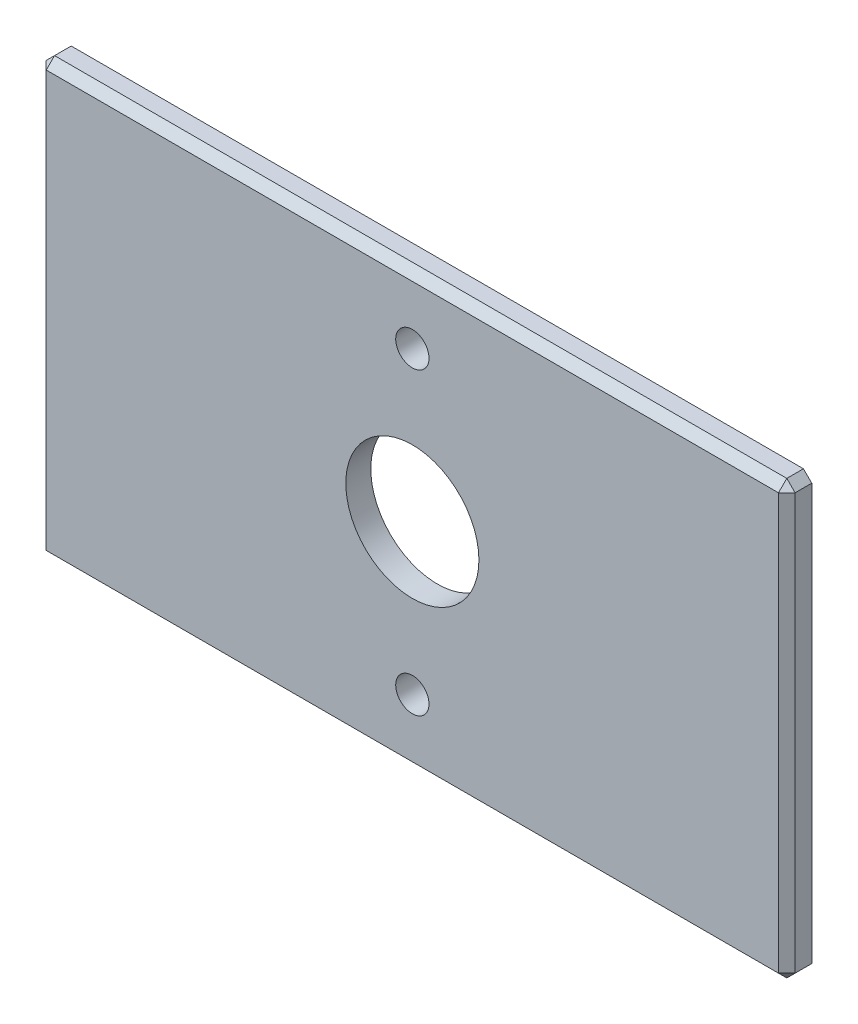
ISO-10303-21;
HEADER;
FILE_DESCRIPTION(('STEP AP214'),'2;1');
FILE_NAME('part.step','',(''),(''),'','','');
FILE_SCHEMA(('AUTOMOTIVE_DESIGN { 1 0 10303 214 1 1 1 1 }'));
ENDSEC;
DATA;
#1=APPLICATION_CONTEXT('core data for automotive mechanical design processes');
#2=APPLICATION_PROTOCOL_DEFINITION('international standard','automotive_design',2000,#1);
#3=PRODUCT_CONTEXT('',#1,'mechanical');
#4=PRODUCT('Part','Part','',(#3));
#5=PRODUCT_RELATED_PRODUCT_CATEGORY('part','',(#4));
#6=PRODUCT_DEFINITION_FORMATION('','',#4);
#7=PRODUCT_DEFINITION_CONTEXT('part definition',#1,'design');
#8=PRODUCT_DEFINITION('design','',#6,#7);
#9=PRODUCT_DEFINITION_SHAPE('','',#8);
#10=(LENGTH_UNIT() NAMED_UNIT(*) SI_UNIT(.MILLI.,.METRE.));
#11=(NAMED_UNIT(*) PLANE_ANGLE_UNIT() SI_UNIT($,.RADIAN.));
#12=(NAMED_UNIT(*) SI_UNIT($,.STERADIAN.) SOLID_ANGLE_UNIT());
#13=UNCERTAINTY_MEASURE_WITH_UNIT(LENGTH_MEASURE(1.E-05),#10,'distance_accuracy_value','');
#14=(GEOMETRIC_REPRESENTATION_CONTEXT(3) GLOBAL_UNCERTAINTY_ASSIGNED_CONTEXT((#13)) GLOBAL_UNIT_ASSIGNED_CONTEXT((#10,
#11,#12)) REPRESENTATION_CONTEXT('',''));
#15=CARTESIAN_POINT('',(0.,0.,0.));
#16=DIRECTION('',(0.,0.,1.));
#17=DIRECTION('',(1.,0.,0.));
#18=AXIS2_PLACEMENT_3D('',#15,#16,#17);
#19=CARTESIAN_POINT('',(0.,0.,0.75));
#20=DIRECTION('',(0.,0.,-1.));
#21=DIRECTION('',(-1.,0.,0.));
#22=AXIS2_PLACEMENT_3D('',#19,#20,#21);
#23=PLANE('',#22);
#24=DIRECTION('',(0.,-1.,0.));
#25=VECTOR('',#24,1.);
#26=CARTESIAN_POINT('',(-22.,0.,0.75));
#27=LINE('',#26,#25);
#28=CARTESIAN_POINT('',(-22.,12.5,0.75));
#29=VERTEX_POINT('',#28);
#30=CARTESIAN_POINT('',(-22.,-12.5,0.75));
#31=VERTEX_POINT('',#30);
#32=EDGE_CURVE('E68',#29,#31,#27,.T.);
#33=ORIENTED_EDGE('',*,*,#32,.T.);
#34=DIRECTION('',(1.,0.,0.));
#35=VECTOR('',#34,1.);
#36=CARTESIAN_POINT('',(0.,-12.5,0.75));
#37=LINE('',#36,#35);
#38=CARTESIAN_POINT('',(22.,-12.5,0.75));
#39=VERTEX_POINT('',#38);
#40=EDGE_CURVE('E11',#31,#39,#37,.T.);
#41=ORIENTED_EDGE('',*,*,#40,.T.);
#42=DIRECTION('',(0.,1.,0.));
#43=VECTOR('',#42,1.);
#44=CARTESIAN_POINT('',(22.,0.,0.75));
#45=LINE('',#44,#43);
#46=CARTESIAN_POINT('',(22.,12.5,0.75));
#47=VERTEX_POINT('',#46);
#48=EDGE_CURVE('E53',#39,#47,#45,.T.);
#49=ORIENTED_EDGE('',*,*,#48,.T.);
#50=DIRECTION('',(-1.,0.,0.));
#51=VECTOR('',#50,1.);
#52=CARTESIAN_POINT('',(0.,12.5,0.75));
#53=LINE('',#52,#51);
#54=EDGE_CURVE('E179',#47,#29,#53,.T.);
#55=ORIENTED_EDGE('',*,*,#54,.T.);
#56=EDGE_LOOP('',(#33,#41,#49,#55));
#57=FACE_BOUND('',#56,.T.);
#58=CARTESIAN_POINT('',(0.,0.,0.75));
#59=DIRECTION('',(0.,0.,1.));
#60=DIRECTION('',(1.,0.,0.));
#61=AXIS2_PLACEMENT_3D('',#58,#59,#60);
#62=CIRCLE('',#61,4.);
#63=CARTESIAN_POINT('',(4.,0.,0.75));
#64=VERTEX_POINT('',#63);
#65=EDGE_CURVE('E234',#64,#64,#62,.T.);
#66=ORIENTED_EDGE('',*,*,#65,.F.);
#67=EDGE_LOOP('',(#66));
#68=FACE_BOUND('',#67,.T.);
#69=CARTESIAN_POINT('',(0.,9.,0.75));
#70=DIRECTION('',(0.,0.,1.));
#71=DIRECTION('',(1.,0.,0.));
#72=AXIS2_PLACEMENT_3D('',#69,#70,#71);
#73=CIRCLE('',#72,1.);
#74=CARTESIAN_POINT('',(1.,9.,0.75));
#75=VERTEX_POINT('',#74);
#76=EDGE_CURVE('E228',#75,#75,#73,.T.);
#77=ORIENTED_EDGE('',*,*,#76,.F.);
#78=EDGE_LOOP('',(#77));
#79=FACE_BOUND('',#78,.T.);
#80=CARTESIAN_POINT('',(0.,-9.,0.75));
#81=DIRECTION('',(0.,0.,1.));
#82=DIRECTION('',(1.,0.,0.));
#83=AXIS2_PLACEMENT_3D('',#80,#81,#82);
#84=CIRCLE('',#83,1.);
#85=CARTESIAN_POINT('',(0.999999999999997,-9.,0.75));
#86=VERTEX_POINT('',#85);
#87=EDGE_CURVE('E220',#86,#86,#84,.T.);
#88=ORIENTED_EDGE('',*,*,#87,.F.);
#89=EDGE_LOOP('',(#88));
#90=FACE_BOUND('',#89,.T.);
#91=ADVANCED_FACE('F43',(#57,#68,#79,#90),#23,.F.);
#92=CARTESIAN_POINT('',(0.,0.,-0.75));
#93=DIRECTION('',(0.,0.,-1.));
#94=DIRECTION('',(-1.,0.,0.));
#95=AXIS2_PLACEMENT_3D('',#92,#93,#94);
#96=PLANE('',#95);
#97=CARTESIAN_POINT('',(0.,9.,-0.75));
#98=DIRECTION('',(0.,0.,1.));
#99=DIRECTION('',(1.,0.,0.));
#100=AXIS2_PLACEMENT_3D('',#97,#98,#99);
#101=CIRCLE('',#100,1.);
#102=CARTESIAN_POINT('',(1.,9.,-0.75));
#103=VERTEX_POINT('',#102);
#104=EDGE_CURVE('E225',#103,#103,#101,.T.);
#105=ORIENTED_EDGE('',*,*,#104,.T.);
#106=EDGE_LOOP('',(#105));
#107=FACE_BOUND('',#106,.T.);
#108=DIRECTION('',(1.,0.,0.));
#109=VECTOR('',#108,1.);
#110=CARTESIAN_POINT('',(-22.5,-13.,-0.75));
#111=LINE('',#110,#109);
#112=CARTESIAN_POINT('',(-22.,-13.,-0.75));
#113=VERTEX_POINT('',#112);
#114=CARTESIAN_POINT('',(22.,-13.,-0.75));
#115=VERTEX_POINT('',#114);
#116=EDGE_CURVE('E140',#113,#115,#111,.T.);
#117=ORIENTED_EDGE('',*,*,#116,.F.);
#118=DIRECTION('',(0.707106781186552,-0.707106781186543,0.));
#119=VECTOR('',#118,1.);
#120=CARTESIAN_POINT('',(-17.4999999999998,-17.5000000000001,-0.75));
#121=LINE('',#120,#119);
#122=CARTESIAN_POINT('',(-22.5,-12.5,-0.75));
#123=VERTEX_POINT('',#122);
#124=EDGE_CURVE('E124',#113,#123,#121,.F.);
#125=ORIENTED_EDGE('',*,*,#124,.T.);
#126=DIRECTION('',(0.,-1.,0.));
#127=VECTOR('',#126,1.);
#128=CARTESIAN_POINT('',(-22.5,-13.,-0.75));
#129=LINE('',#128,#127);
#130=CARTESIAN_POINT('',(-22.5,12.5,-0.75));
#131=VERTEX_POINT('',#130);
#132=EDGE_CURVE('E151',#131,#123,#129,.T.);
#133=ORIENTED_EDGE('',*,*,#132,.F.);
#134=DIRECTION('',(-0.707106781186543,-0.707106781186552,0.));
#135=VECTOR('',#134,1.);
#136=CARTESIAN_POINT('',(-17.5000000000002,17.4999999999999,-0.75));
#137=LINE('',#136,#135);
#138=CARTESIAN_POINT('',(-22.,13.,-0.75));
#139=VERTEX_POINT('',#138);
#140=EDGE_CURVE('E144',#131,#139,#137,.F.);
#141=ORIENTED_EDGE('',*,*,#140,.T.);
#142=DIRECTION('',(-1.,0.,0.));
#143=VECTOR('',#142,1.);
#144=CARTESIAN_POINT('',(-22.5,13.,-0.75));
#145=LINE('',#144,#143);
#146=CARTESIAN_POINT('',(22.,13.,-0.75));
#147=VERTEX_POINT('',#146);
#148=EDGE_CURVE('E154',#147,#139,#145,.T.);
#149=ORIENTED_EDGE('',*,*,#148,.F.);
#150=DIRECTION('',(-0.707106781186538,0.707106781186557,0.));
#151=VECTOR('',#150,1.);
#152=CARTESIAN_POINT('',(17.5000000000003,17.4999999999998,-0.75));
#153=LINE('',#152,#151);
#154=CARTESIAN_POINT('',(22.5,12.5,-0.75));
#155=VERTEX_POINT('',#154);
#156=EDGE_CURVE('E160',#147,#155,#153,.F.);
#157=ORIENTED_EDGE('',*,*,#156,.T.);
#158=DIRECTION('',(0.,1.,0.));
#159=VECTOR('',#158,1.);
#160=CARTESIAN_POINT('',(22.5,-13.,-0.75));
#161=LINE('',#160,#159);
#162=CARTESIAN_POINT('',(22.5,-12.5,-0.75));
#163=VERTEX_POINT('',#162);
#164=EDGE_CURVE('E237',#163,#155,#161,.T.);
#165=ORIENTED_EDGE('',*,*,#164,.F.);
#166=DIRECTION('',(0.707106781186543,0.707106781186552,0.));
#167=VECTOR('',#166,1.);
#168=CARTESIAN_POINT('',(17.5000000000002,-17.4999999999999,-0.75));
#169=LINE('',#168,#167);
#170=EDGE_CURVE('E135',#163,#115,#169,.F.);
#171=ORIENTED_EDGE('',*,*,#170,.T.);
#172=EDGE_LOOP('',(#117,#125,#133,#141,#149,#157,#165,#171));
#173=FACE_BOUND('',#172,.T.);
#174=CARTESIAN_POINT('',(0.,0.,-0.75));
#175=DIRECTION('',(0.,0.,1.));
#176=DIRECTION('',(1.,0.,0.));
#177=AXIS2_PLACEMENT_3D('',#174,#175,#176);
#178=CIRCLE('',#177,4.);
#179=CARTESIAN_POINT('',(4.,0.,-0.75));
#180=VERTEX_POINT('',#179);
#181=EDGE_CURVE('E231',#180,#180,#178,.T.);
#182=ORIENTED_EDGE('',*,*,#181,.T.);
#183=EDGE_LOOP('',(#182));
#184=FACE_BOUND('',#183,.T.);
#185=CARTESIAN_POINT('',(0.,-9.,-0.75));
#186=DIRECTION('',(0.,0.,1.));
#187=DIRECTION('',(1.,0.,0.));
#188=AXIS2_PLACEMENT_3D('',#185,#186,#187);
#189=CIRCLE('',#188,1.);
#190=CARTESIAN_POINT('',(0.999999999999997,-9.,-0.75));
#191=VERTEX_POINT('',#190);
#192=EDGE_CURVE('E215',#191,#191,#189,.T.);
#193=ORIENTED_EDGE('',*,*,#192,.T.);
#194=EDGE_LOOP('',(#193));
#195=FACE_BOUND('',#194,.T.);
#196=ADVANCED_FACE('F147',(#107,#173,#184,#195),#96,.T.);
#197=CARTESIAN_POINT('',(22.5,-13.,0.75));
#198=DIRECTION('',(-1.,0.,0.));
#199=DIRECTION('',(0.,-1.,0.));
#200=AXIS2_PLACEMENT_3D('',#197,#198,#199);
#201=PLANE('',#200);
#202=DIRECTION('',(0.,-1.,0.));
#203=VECTOR('',#202,1.);
#204=CARTESIAN_POINT('',(22.5,-13.,0.25));
#205=LINE('',#204,#203);
#206=CARTESIAN_POINT('',(22.5,12.5,0.25));
#207=VERTEX_POINT('',#206);
#208=CARTESIAN_POINT('',(22.5,-12.5,0.25));
#209=VERTEX_POINT('',#208);
#210=EDGE_CURVE('E167',#207,#209,#205,.T.);
#211=ORIENTED_EDGE('',*,*,#210,.T.);
#212=DIRECTION('',(0.,0.,-1.));
#213=VECTOR('',#212,1.);
#214=CARTESIAN_POINT('',(22.5,-12.5,0.75));
#215=LINE('',#214,#213);
#216=EDGE_CURVE('E171',#209,#163,#215,.T.);
#217=ORIENTED_EDGE('',*,*,#216,.T.);
#218=ORIENTED_EDGE('',*,*,#164,.T.);
#219=DIRECTION('',(0.,0.,1.));
#220=VECTOR('',#219,1.);
#221=CARTESIAN_POINT('',(22.5,12.5,0.75));
#222=LINE('',#221,#220);
#223=EDGE_CURVE('E169',#155,#207,#222,.T.);
#224=ORIENTED_EDGE('',*,*,#223,.T.);
#225=EDGE_LOOP('',(#211,#217,#218,#224));
#226=FACE_BOUND('',#225,.T.);
#227=ADVANCED_FACE('F261',(#226),#201,.F.);
#228=CARTESIAN_POINT('',(-22.5,13.,0.75));
#229=DIRECTION('',(0.,-1.,0.));
#230=DIRECTION('',(1.,0.,0.));
#231=AXIS2_PLACEMENT_3D('',#228,#229,#230);
#232=PLANE('',#231);
#233=DIRECTION('',(1.,0.,0.));
#234=VECTOR('',#233,1.);
#235=CARTESIAN_POINT('',(-22.5,13.,0.25));
#236=LINE('',#235,#234);
#237=CARTESIAN_POINT('',(-22.,13.,0.25));
#238=VERTEX_POINT('',#237);
#239=CARTESIAN_POINT('',(22.,13.,0.25));
#240=VERTEX_POINT('',#239);
#241=EDGE_CURVE('E173',#238,#240,#236,.T.);
#242=ORIENTED_EDGE('',*,*,#241,.T.);
#243=DIRECTION('',(0.,0.,-1.));
#244=VECTOR('',#243,1.);
#245=CARTESIAN_POINT('',(22.,13.,0.75));
#246=LINE('',#245,#244);
#247=EDGE_CURVE('E177',#240,#147,#246,.T.);
#248=ORIENTED_EDGE('',*,*,#247,.T.);
#249=ORIENTED_EDGE('',*,*,#148,.T.);
#250=DIRECTION('',(0.,0.,1.));
#251=VECTOR('',#250,1.);
#252=CARTESIAN_POINT('',(-22.,13.,0.75));
#253=LINE('',#252,#251);
#254=EDGE_CURVE('E175',#139,#238,#253,.T.);
#255=ORIENTED_EDGE('',*,*,#254,.T.);
#256=EDGE_LOOP('',(#242,#248,#249,#255));
#257=FACE_BOUND('',#256,.T.);
#258=ADVANCED_FACE('F245',(#257),#232,.F.);
#259=CARTESIAN_POINT('',(-22.5,-13.,0.75));
#260=DIRECTION('',(1.,0.,0.));
#261=DIRECTION('',(0.,0.,-1.));
#262=AXIS2_PLACEMENT_3D('',#259,#260,#261);
#263=PLANE('',#262);
#264=ORIENTED_EDGE('',*,*,#132,.T.);
#265=DIRECTION('',(0.,0.,1.));
#266=VECTOR('',#265,1.);
#267=CARTESIAN_POINT('',(-22.5,-12.5,0.75));
#268=LINE('',#267,#266);
#269=CARTESIAN_POINT('',(-22.5,-12.5,0.25));
#270=VERTEX_POINT('',#269);
#271=EDGE_CURVE('E129',#123,#270,#268,.T.);
#272=ORIENTED_EDGE('',*,*,#271,.T.);
#273=DIRECTION('',(0.,1.,0.));
#274=VECTOR('',#273,1.);
#275=CARTESIAN_POINT('',(-22.5,-13.,0.25));
#276=LINE('',#275,#274);
#277=CARTESIAN_POINT('',(-22.5,12.5,0.25));
#278=VERTEX_POINT('',#277);
#279=EDGE_CURVE('E134',#270,#278,#276,.T.);
#280=ORIENTED_EDGE('',*,*,#279,.T.);
#281=DIRECTION('',(0.,0.,-1.));
#282=VECTOR('',#281,1.);
#283=CARTESIAN_POINT('',(-22.5,12.5,0.75));
#284=LINE('',#283,#282);
#285=EDGE_CURVE('E164',#278,#131,#284,.T.);
#286=ORIENTED_EDGE('',*,*,#285,.T.);
#287=EDGE_LOOP('',(#264,#272,#280,#286));
#288=FACE_BOUND('',#287,.T.);
#289=ADVANCED_FACE('F282',(#288),#263,.F.);
#290=CARTESIAN_POINT('',(-22.5,-13.,0.75));
#291=DIRECTION('',(0.,1.,0.));
#292=DIRECTION('',(-1.,0.,0.));
#293=AXIS2_PLACEMENT_3D('',#290,#291,#292);
#294=PLANE('',#293);
#295=DIRECTION('',(-1.,0.,0.));
#296=VECTOR('',#295,1.);
#297=CARTESIAN_POINT('',(-22.5,-13.,0.25));
#298=LINE('',#297,#296);
#299=CARTESIAN_POINT('',(22.,-13.,0.25));
#300=VERTEX_POINT('',#299);
#301=CARTESIAN_POINT('',(-22.,-13.,0.25));
#302=VERTEX_POINT('',#301);
#303=EDGE_CURVE('E142',#300,#302,#298,.T.);
#304=ORIENTED_EDGE('',*,*,#303,.T.);
#305=DIRECTION('',(0.,0.,-1.));
#306=VECTOR('',#305,1.);
#307=CARTESIAN_POINT('',(-22.,-13.,0.75));
#308=LINE('',#307,#306);
#309=EDGE_CURVE('E128',#302,#113,#308,.T.);
#310=ORIENTED_EDGE('',*,*,#309,.T.);
#311=ORIENTED_EDGE('',*,*,#116,.T.);
#312=DIRECTION('',(0.,0.,1.));
#313=VECTOR('',#312,1.);
#314=CARTESIAN_POINT('',(22.,-13.,0.75));
#315=LINE('',#314,#313);
#316=EDGE_CURVE('E145',#115,#300,#315,.T.);
#317=ORIENTED_EDGE('',*,*,#316,.T.);
#318=EDGE_LOOP('',(#304,#310,#311,#317));
#319=FACE_BOUND('',#318,.T.);
#320=ADVANCED_FACE('F139',(#319),#294,.F.);
#321=CARTESIAN_POINT('',(0.,0.,0.75));
#322=DIRECTION('',(0.,0.,-1.));
#323=DIRECTION('',(-1.,0.,0.));
#324=AXIS2_PLACEMENT_3D('',#321,#322,#323);
#325=CYLINDRICAL_SURFACE('',#324,4.);
#326=ORIENTED_EDGE('',*,*,#65,.T.);
#327=EDGE_LOOP('',(#326));
#328=FACE_BOUND('',#327,.T.);
#329=ORIENTED_EDGE('',*,*,#181,.F.);
#330=EDGE_LOOP('',(#329));
#331=FACE_BOUND('',#330,.T.);
#332=ADVANCED_FACE('F289',(#328,#331),#325,.F.);
#333=CARTESIAN_POINT('',(0.,9.,0.75));
#334=DIRECTION('',(0.,0.,-1.));
#335=DIRECTION('',(-1.,0.,0.));
#336=AXIS2_PLACEMENT_3D('',#333,#334,#335);
#337=CYLINDRICAL_SURFACE('',#336,1.);
#338=ORIENTED_EDGE('',*,*,#76,.T.);
#339=EDGE_LOOP('',(#338));
#340=FACE_BOUND('',#339,.T.);
#341=ORIENTED_EDGE('',*,*,#104,.F.);
#342=EDGE_LOOP('',(#341));
#343=FACE_BOUND('',#342,.T.);
#344=ADVANCED_FACE('F304',(#340,#343),#337,.F.);
#345=CARTESIAN_POINT('',(0.,-9.,0.75));
#346=DIRECTION('',(0.,0.,-1.));
#347=DIRECTION('',(-1.,0.,0.));
#348=AXIS2_PLACEMENT_3D('',#345,#346,#347);
#349=CYLINDRICAL_SURFACE('',#348,1.);
#350=ORIENTED_EDGE('',*,*,#87,.T.);
#351=EDGE_LOOP('',(#350));
#352=FACE_BOUND('',#351,.T.);
#353=ORIENTED_EDGE('',*,*,#192,.F.);
#354=EDGE_LOOP('',(#353));
#355=FACE_BOUND('',#354,.T.);
#356=ADVANCED_FACE('F308',(#352,#355),#349,.F.);
#357=CARTESIAN_POINT('',(22.,13.,0.75));
#358=DIRECTION('',(-0.707106781186557,-0.707106781186538,0.));
#359=DIRECTION('',(0.,0.,-1.));
#360=AXIS2_PLACEMENT_3D('',#357,#358,#359);
#361=PLANE('',#360);
#362=DIRECTION('',(0.707106781186538,-0.707106781186557,0.));
#363=VECTOR('',#362,1.);
#364=CARTESIAN_POINT('',(22.5,12.5,0.25));
#365=LINE('',#364,#363);
#366=EDGE_CURVE('E48',#207,#240,#365,.F.);
#367=ORIENTED_EDGE('',*,*,#366,.F.);
#368=ORIENTED_EDGE('',*,*,#223,.F.);
#369=ORIENTED_EDGE('',*,*,#156,.F.);
#370=ORIENTED_EDGE('',*,*,#247,.F.);
#371=EDGE_LOOP('',(#367,#368,#369,#370));
#372=FACE_BOUND('',#371,.T.);
#373=ADVANCED_FACE('F46',(#372),#361,.F.);
#374=CARTESIAN_POINT('',(22.5,12.5,0.25));
#375=DIRECTION('',(0.577350269189628,0.577350269189612,0.577350269189638));
#376=DIRECTION('',(0.707106781186554,0.,-0.707106781186541));
#377=AXIS2_PLACEMENT_3D('',#374,#375,#376);
#378=PLANE('',#377);
#379=DIRECTION('',(-0.707106781186554,0.,0.707106781186541));
#380=VECTOR('',#379,1.);
#381=CARTESIAN_POINT('',(22.5,12.5,0.25));
#382=LINE('',#381,#380);
#383=EDGE_CURVE('E206',#207,#47,#382,.T.);
#384=ORIENTED_EDGE('',*,*,#383,.F.);
#385=ORIENTED_EDGE('',*,*,#366,.T.);
#386=DIRECTION('',(0.,0.707106781186553,-0.707106781186542));
#387=VECTOR('',#386,1.);
#388=CARTESIAN_POINT('',(22.,12.75,0.499999999999998));
#389=LINE('',#388,#387);
#390=EDGE_CURVE('E208',#47,#240,#389,.T.);
#391=ORIENTED_EDGE('',*,*,#390,.F.);
#392=EDGE_LOOP('',(#384,#385,#391));
#393=FACE_BOUND('',#392,.T.);
#394=ADVANCED_FACE('F314',(#393),#378,.T.);
#395=CARTESIAN_POINT('',(-22.5,12.5,0.75));
#396=DIRECTION('',(0.707106781186552,-0.707106781186542,0.));
#397=DIRECTION('',(0.,0.,-1.));
#398=AXIS2_PLACEMENT_3D('',#395,#396,#397);
#399=PLANE('',#398);
#400=ORIENTED_EDGE('',*,*,#140,.F.);
#401=ORIENTED_EDGE('',*,*,#285,.F.);
#402=DIRECTION('',(0.707106781186542,0.707106781186552,0.));
#403=VECTOR('',#402,1.);
#404=CARTESIAN_POINT('',(-22.,13.,0.25));
#405=LINE('',#404,#403);
#406=EDGE_CURVE('E203',#238,#278,#405,.F.);
#407=ORIENTED_EDGE('',*,*,#406,.F.);
#408=ORIENTED_EDGE('',*,*,#254,.F.);
#409=EDGE_LOOP('',(#400,#401,#407,#408));
#410=FACE_BOUND('',#409,.T.);
#411=ADVANCED_FACE('F251',(#410),#399,.F.);
#412=CARTESIAN_POINT('',(0.,12.5,0.75));
#413=DIRECTION('',(0.,-0.707106781186542,-0.707106781186553));
#414=DIRECTION('',(-1.,0.,0.));
#415=AXIS2_PLACEMENT_3D('',#412,#413,#414);
#416=PLANE('',#415);
#417=ORIENTED_EDGE('',*,*,#390,.T.);
#418=ORIENTED_EDGE('',*,*,#241,.F.);
#419=DIRECTION('',(0.,-0.707106781186553,0.707106781186542));
#420=VECTOR('',#419,1.);
#421=CARTESIAN_POINT('',(-22.,13.,0.25));
#422=LINE('',#421,#420);
#423=EDGE_CURVE('E200',#29,#238,#422,.F.);
#424=ORIENTED_EDGE('',*,*,#423,.F.);
#425=ORIENTED_EDGE('',*,*,#54,.F.);
#426=EDGE_LOOP('',(#417,#418,#424,#425));
#427=FACE_BOUND('',#426,.T.);
#428=ADVANCED_FACE('F257',(#427),#416,.F.);
#429=CARTESIAN_POINT('',(22.,0.,0.75));
#430=DIRECTION('',(-0.707106781186541,0.,-0.707106781186554));
#431=DIRECTION('',(0.,1.,0.));
#432=AXIS2_PLACEMENT_3D('',#429,#430,#431);
#433=PLANE('',#432);
#434=ORIENTED_EDGE('',*,*,#383,.T.);
#435=ORIENTED_EDGE('',*,*,#48,.F.);
#436=DIRECTION('',(0.707106781186554,0.,-0.707106781186541));
#437=VECTOR('',#436,1.);
#438=CARTESIAN_POINT('',(22.25,-12.5,0.499999999999998));
#439=LINE('',#438,#437);
#440=EDGE_CURVE('E198',#209,#39,#439,.F.);
#441=ORIENTED_EDGE('',*,*,#440,.F.);
#442=ORIENTED_EDGE('',*,*,#210,.F.);
#443=EDGE_LOOP('',(#434,#435,#441,#442));
#444=FACE_BOUND('',#443,.T.);
#445=ADVANCED_FACE('F270',(#444),#433,.F.);
#446=CARTESIAN_POINT('',(22.5,-12.5,0.75));
#447=DIRECTION('',(-0.707106781186552,0.707106781186542,0.));
#448=DIRECTION('',(0.,0.,-1.));
#449=AXIS2_PLACEMENT_3D('',#446,#447,#448);
#450=PLANE('',#449);
#451=ORIENTED_EDGE('',*,*,#170,.F.);
#452=ORIENTED_EDGE('',*,*,#216,.F.);
#453=DIRECTION('',(-0.707106781186543,-0.707106781186552,0.));
#454=VECTOR('',#453,1.);
#455=CARTESIAN_POINT('',(22.,-13.,0.25));
#456=LINE('',#455,#454);
#457=EDGE_CURVE('E195',#300,#209,#456,.F.);
#458=ORIENTED_EDGE('',*,*,#457,.F.);
#459=ORIENTED_EDGE('',*,*,#316,.F.);
#460=EDGE_LOOP('',(#451,#452,#458,#459));
#461=FACE_BOUND('',#460,.T.);
#462=ADVANCED_FACE('F267',(#461),#450,.F.);
#463=CARTESIAN_POINT('',(-22.,13.,0.25));
#464=DIRECTION('',(-0.577350269189625,0.577350269189617,0.577350269189635));
#465=DIRECTION('',(0.707106781186554,0.,0.707106781186541));
#466=AXIS2_PLACEMENT_3D('',#463,#464,#465);
#467=PLANE('',#466);
#468=ORIENTED_EDGE('',*,*,#423,.T.);
#469=ORIENTED_EDGE('',*,*,#406,.T.);
#470=DIRECTION('',(-0.707106781186552,0.,-0.707106781186542));
#471=VECTOR('',#470,1.);
#472=CARTESIAN_POINT('',(-22.25,12.5,0.499999999999999));
#473=LINE('',#472,#471);
#474=EDGE_CURVE('E192',#29,#278,#473,.T.);
#475=ORIENTED_EDGE('',*,*,#474,.F.);
#476=EDGE_LOOP('',(#468,#469,#475));
#477=FACE_BOUND('',#476,.T.);
#478=ADVANCED_FACE('F256',(#477),#467,.T.);
#479=CARTESIAN_POINT('',(22.,-13.,0.25));
#480=DIRECTION('',(0.577350269189624,-0.577350269189616,0.577350269189638));
#481=DIRECTION('',(0.707106781186556,0.,-0.707106781186539));
#482=AXIS2_PLACEMENT_3D('',#479,#480,#481);
#483=PLANE('',#482);
#484=ORIENTED_EDGE('',*,*,#457,.T.);
#485=ORIENTED_EDGE('',*,*,#440,.T.);
#486=DIRECTION('',(0.,0.707106781186553,0.707106781186542));
#487=VECTOR('',#486,1.);
#488=CARTESIAN_POINT('',(22.,-13.,0.25));
#489=LINE('',#488,#487);
#490=EDGE_CURVE('E61',#300,#39,#489,.T.);
#491=ORIENTED_EDGE('',*,*,#490,.F.);
#492=EDGE_LOOP('',(#484,#485,#491));
#493=FACE_BOUND('',#492,.T.);
#494=ADVANCED_FACE('F272',(#493),#483,.T.);
#495=CARTESIAN_POINT('',(-22.,0.,0.75));
#496=DIRECTION('',(0.707106781186542,0.,-0.707106781186552));
#497=DIRECTION('',(0.,-1.,0.));
#498=AXIS2_PLACEMENT_3D('',#495,#496,#497);
#499=PLANE('',#498);
#500=ORIENTED_EDGE('',*,*,#474,.T.);
#501=ORIENTED_EDGE('',*,*,#279,.F.);
#502=DIRECTION('',(0.707106781186552,0.,0.707106781186543));
#503=VECTOR('',#502,1.);
#504=CARTESIAN_POINT('',(-22.5,-12.5,0.25));
#505=LINE('',#504,#503);
#506=EDGE_CURVE('E188',#31,#270,#505,.F.);
#507=ORIENTED_EDGE('',*,*,#506,.F.);
#508=ORIENTED_EDGE('',*,*,#32,.F.);
#509=EDGE_LOOP('',(#500,#501,#507,#508));
#510=FACE_BOUND('',#509,.T.);
#511=ADVANCED_FACE('F280',(#510),#499,.F.);
#512=CARTESIAN_POINT('',(0.,-12.5,0.75));
#513=DIRECTION('',(0.,0.707106781186542,-0.707106781186553));
#514=DIRECTION('',(1.,0.,0.));
#515=AXIS2_PLACEMENT_3D('',#512,#513,#514);
#516=PLANE('',#515);
#517=ORIENTED_EDGE('',*,*,#490,.T.);
#518=ORIENTED_EDGE('',*,*,#40,.F.);
#519=DIRECTION('',(0.,-0.707106781186553,-0.707106781186542));
#520=VECTOR('',#519,1.);
#521=CARTESIAN_POINT('',(-22.,-12.75,0.499999999999999));
#522=LINE('',#521,#520);
#523=EDGE_CURVE('E185',#302,#31,#522,.F.);
#524=ORIENTED_EDGE('',*,*,#523,.F.);
#525=ORIENTED_EDGE('',*,*,#303,.F.);
#526=EDGE_LOOP('',(#517,#518,#524,#525));
#527=FACE_BOUND('',#526,.T.);
#528=ADVANCED_FACE('F273',(#527),#516,.F.);
#529=CARTESIAN_POINT('',(-22.5,-12.5,0.25));
#530=DIRECTION('',(-0.577350269189617,-0.577350269189625,0.577350269189635));
#531=DIRECTION('',(0.,-0.707106781186554,-0.707106781186541));
#532=AXIS2_PLACEMENT_3D('',#529,#530,#531);
#533=PLANE('',#532);
#534=ORIENTED_EDGE('',*,*,#523,.T.);
#535=ORIENTED_EDGE('',*,*,#506,.T.);
#536=DIRECTION('',(-0.707106781186552,0.707106781186543,0.));
#537=VECTOR('',#536,1.);
#538=CARTESIAN_POINT('',(-22.5,-12.5,0.25));
#539=LINE('',#538,#537);
#540=EDGE_CURVE('E183',#302,#270,#539,.T.);
#541=ORIENTED_EDGE('',*,*,#540,.F.);
#542=EDGE_LOOP('',(#534,#535,#541));
#543=FACE_BOUND('',#542,.T.);
#544=ADVANCED_FACE('F277',(#543),#533,.T.);
#545=CARTESIAN_POINT('',(-22.,-13.,0.75));
#546=DIRECTION('',(0.707106781186542,0.707106781186552,0.));
#547=DIRECTION('',(0.,0.,-1.));
#548=AXIS2_PLACEMENT_3D('',#545,#546,#547);
#549=PLANE('',#548);
#550=ORIENTED_EDGE('',*,*,#540,.T.);
#551=ORIENTED_EDGE('',*,*,#271,.F.);
#552=ORIENTED_EDGE('',*,*,#124,.F.);
#553=ORIENTED_EDGE('',*,*,#309,.F.);
#554=EDGE_LOOP('',(#550,#551,#552,#553));
#555=FACE_BOUND('',#554,.T.);
#556=ADVANCED_FACE('F127',(#555),#549,.F.);
#557=CLOSED_SHELL('',(#91,#196,#227,#258,#289,#320,#332,#344,#356,#373,#394,#411,#428,#445,#462,
#478,#494,#511,#528,#544,#556));
#558=MANIFOLD_SOLID_BREP('B2',#557);
#559=ADVANCED_BREP_SHAPE_REPRESENTATION('',(#18,#558),#14);
#560=SHAPE_DEFINITION_REPRESENTATION(#9,#559);
ENDSEC;
END-ISO-10303-21;
